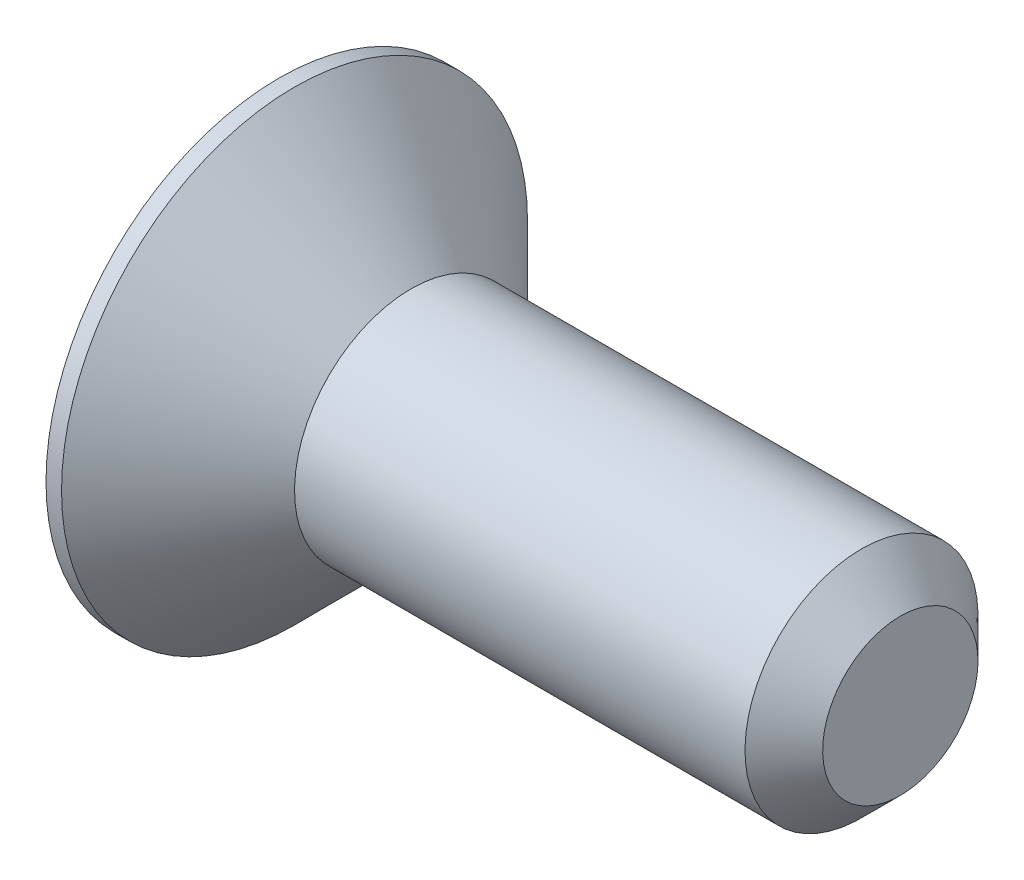
ISO-10303-21;
HEADER;
FILE_DESCRIPTION(('STEP AP214'),'2;1');
FILE_NAME('part.step','',(''),(''),'','','');
FILE_SCHEMA(('AUTOMOTIVE_DESIGN { 1 0 10303 214 1 1 1 1 }'));
ENDSEC;
DATA;
#1=APPLICATION_CONTEXT('core data for automotive mechanical design processes');
#2=APPLICATION_PROTOCOL_DEFINITION('international standard','automotive_design',2000,#1);
#3=PRODUCT_CONTEXT('',#1,'mechanical');
#4=PRODUCT('Part','Part','',(#3));
#5=PRODUCT_RELATED_PRODUCT_CATEGORY('part','',(#4));
#6=PRODUCT_DEFINITION_FORMATION('','',#4);
#7=PRODUCT_DEFINITION_CONTEXT('part definition',#1,'design');
#8=PRODUCT_DEFINITION('design','',#6,#7);
#9=PRODUCT_DEFINITION_SHAPE('','',#8);
#10=(LENGTH_UNIT() NAMED_UNIT(*) SI_UNIT(.MILLI.,.METRE.));
#11=(NAMED_UNIT(*) PLANE_ANGLE_UNIT() SI_UNIT($,.RADIAN.));
#12=(NAMED_UNIT(*) SI_UNIT($,.STERADIAN.) SOLID_ANGLE_UNIT());
#13=UNCERTAINTY_MEASURE_WITH_UNIT(LENGTH_MEASURE(1.E-05),#10,'distance_accuracy_value','');
#14=(GEOMETRIC_REPRESENTATION_CONTEXT(3) GLOBAL_UNCERTAINTY_ASSIGNED_CONTEXT((#13)) GLOBAL_UNIT_ASSIGNED_CONTEXT((#10,
#11,#12)) REPRESENTATION_CONTEXT('',''));
#15=CARTESIAN_POINT('',(0.,0.,0.));
#16=DIRECTION('',(0.,0.,1.));
#17=DIRECTION('',(1.,0.,0.));
#18=AXIS2_PLACEMENT_3D('',#15,#16,#17);
#19=CARTESIAN_POINT('',(0.,0.,0.));
#20=DIRECTION('',(-1.,0.,0.));
#21=DIRECTION('',(0.,-1.,0.));
#22=AXIS2_PLACEMENT_3D('',#19,#20,#21);
#23=PLANE('',#22);
#24=DIRECTION('',(0.,0.5,-0.866025403784438));
#25=VECTOR('',#24,1.);
#26=CARTESIAN_POINT('',(0.,0.577350269189626,1.));
#27=LINE('',#26,#25);
#28=CARTESIAN_POINT('',(0.,0.577350269189626,1.));
#29=VERTEX_POINT('',#28);
#30=CARTESIAN_POINT('',(0.,1.15470053837925,0.));
#31=VERTEX_POINT('',#30);
#32=EDGE_CURVE('E48',#29,#31,#27,.T.);
#33=ORIENTED_EDGE('',*,*,#32,.F.);
#34=DIRECTION('',(0.,1.,0.));
#35=VECTOR('',#34,1.);
#36=CARTESIAN_POINT('',(0.,-0.577350269189626,1.));
#37=LINE('',#36,#35);
#38=CARTESIAN_POINT('',(0.,-0.577350269189626,1.));
#39=VERTEX_POINT('',#38);
#40=EDGE_CURVE('E131',#39,#29,#37,.T.);
#41=ORIENTED_EDGE('',*,*,#40,.F.);
#42=DIRECTION('',(0.,0.5,0.866025403784439));
#43=VECTOR('',#42,1.);
#44=CARTESIAN_POINT('',(0.,-1.15470053837925,0.));
#45=LINE('',#44,#43);
#46=CARTESIAN_POINT('',(0.,-1.15470053837925,0.));
#47=VERTEX_POINT('',#46);
#48=EDGE_CURVE('E129',#47,#39,#45,.T.);
#49=ORIENTED_EDGE('',*,*,#48,.F.);
#50=DIRECTION('',(0.,-0.5,0.866025403784439));
#51=VECTOR('',#50,1.);
#52=CARTESIAN_POINT('',(0.,-0.577350269189625,-1.));
#53=LINE('',#52,#51);
#54=CARTESIAN_POINT('',(0.,-0.577350269189625,-1.));
#55=VERTEX_POINT('',#54);
#56=EDGE_CURVE('E96',#55,#47,#53,.T.);
#57=ORIENTED_EDGE('',*,*,#56,.F.);
#58=DIRECTION('',(0.,-1.,0.));
#59=VECTOR('',#58,1.);
#60=CARTESIAN_POINT('',(0.,0.577350269189626,-1.));
#61=LINE('',#60,#59);
#62=CARTESIAN_POINT('',(0.,0.577350269189626,-1.));
#63=VERTEX_POINT('',#62);
#64=EDGE_CURVE('E125',#63,#55,#61,.T.);
#65=ORIENTED_EDGE('',*,*,#64,.F.);
#66=DIRECTION('',(0.,-0.5,-0.866025403784439));
#67=VECTOR('',#66,1.);
#68=CARTESIAN_POINT('',(0.,1.15470053837925,0.));
#69=LINE('',#68,#67);
#70=EDGE_CURVE('E122',#31,#63,#69,.T.);
#71=ORIENTED_EDGE('',*,*,#70,.F.);
#72=EDGE_LOOP('',(#33,#41,#49,#57,#65,#71));
#73=FACE_BOUND('',#72,.T.);
#74=CARTESIAN_POINT('',(0.,0.,0.));
#75=DIRECTION('',(1.,0.,0.));
#76=DIRECTION('',(0.,1.,0.));
#77=AXIS2_PLACEMENT_3D('',#74,#75,#76);
#78=CIRCLE('',#77,3.);
#79=CARTESIAN_POINT('',(0.,3.,0.));
#80=VERTEX_POINT('',#79);
#81=EDGE_CURVE('E146',#80,#80,#78,.T.);
#82=ORIENTED_EDGE('',*,*,#81,.F.);
#83=EDGE_LOOP('',(#82));
#84=FACE_BOUND('',#83,.T.);
#85=ADVANCED_FACE('F33',(#73,#84),#23,.T.);
#86=CARTESIAN_POINT('',(8.,0.,0.));
#87=DIRECTION('',(1.,0.,0.));
#88=DIRECTION('',(0.,1.,0.));
#89=AXIS2_PLACEMENT_3D('',#86,#87,#88);
#90=CYLINDRICAL_SURFACE('',#89,3.);
#91=ORIENTED_EDGE('',*,*,#81,.T.);
#92=EDGE_LOOP('',(#91));
#93=FACE_BOUND('',#92,.T.);
#94=CARTESIAN_POINT('',(0.199999999999964,0.,0.));
#95=DIRECTION('',(1.,0.,0.));
#96=DIRECTION('',(0.,1.,0.));
#97=AXIS2_PLACEMENT_3D('',#94,#95,#96);
#98=CIRCLE('',#97,3.);
#99=CARTESIAN_POINT('',(0.199999999999964,3.,0.));
#100=VERTEX_POINT('',#99);
#101=EDGE_CURVE('E143',#100,#100,#98,.T.);
#102=ORIENTED_EDGE('',*,*,#101,.F.);
#103=EDGE_LOOP('',(#102));
#104=FACE_BOUND('',#103,.T.);
#105=ADVANCED_FACE('F166',(#93,#104),#90,.T.);
#106=CARTESIAN_POINT('',(1.7,0.,0.));
#107=DIRECTION('',(-1.,0.,0.));
#108=DIRECTION('',(0.,-1.,0.));
#109=AXIS2_PLACEMENT_3D('',#106,#107,#108);
#110=CONICAL_SURFACE('',#109,1.5,0.785398163397437);
#111=ORIENTED_EDGE('',*,*,#101,.T.);
#112=EDGE_LOOP('',(#111));
#113=FACE_BOUND('',#112,.T.);
#114=CARTESIAN_POINT('',(1.7,0.,0.));
#115=DIRECTION('',(1.,0.,0.));
#116=DIRECTION('',(0.,1.,0.));
#117=AXIS2_PLACEMENT_3D('',#114,#115,#116);
#118=CIRCLE('',#117,1.5);
#119=CARTESIAN_POINT('',(1.7,1.5,0.));
#120=VERTEX_POINT('',#119);
#121=EDGE_CURVE('E135',#120,#120,#118,.T.);
#122=ORIENTED_EDGE('',*,*,#121,.F.);
#123=EDGE_LOOP('',(#122));
#124=FACE_BOUND('',#123,.T.);
#125=ADVANCED_FACE('F171',(#113,#124),#110,.T.);
#126=CARTESIAN_POINT('',(8.,0.,0.));
#127=DIRECTION('',(1.,0.,0.));
#128=DIRECTION('',(0.,1.,0.));
#129=AXIS2_PLACEMENT_3D('',#126,#127,#128);
#130=CYLINDRICAL_SURFACE('',#129,1.5);
#131=CARTESIAN_POINT('',(7.5,0.,0.));
#132=DIRECTION('',(1.,0.,0.));
#133=DIRECTION('',(0.,1.,0.));
#134=AXIS2_PLACEMENT_3D('',#131,#132,#133);
#135=CIRCLE('',#134,1.5);
#136=CARTESIAN_POINT('',(7.5,1.5,0.));
#137=VERTEX_POINT('',#136);
#138=EDGE_CURVE('E11',#137,#137,#135,.F.);
#139=ORIENTED_EDGE('',*,*,#138,.T.);
#140=EDGE_LOOP('',(#139));
#141=FACE_BOUND('',#140,.T.);
#142=ORIENTED_EDGE('',*,*,#121,.T.);
#143=EDGE_LOOP('',(#142));
#144=FACE_BOUND('',#143,.T.);
#145=ADVANCED_FACE('F162',(#141,#144),#130,.T.);
#146=CARTESIAN_POINT('',(8.,1.5,0.));
#147=DIRECTION('',(1.,0.,0.));
#148=DIRECTION('',(0.,1.,0.));
#149=AXIS2_PLACEMENT_3D('',#146,#147,#148);
#150=PLANE('',#149);
#151=CARTESIAN_POINT('',(8.,0.,0.));
#152=DIRECTION('',(1.,0.,0.));
#153=DIRECTION('',(0.,1.,0.));
#154=AXIS2_PLACEMENT_3D('',#151,#152,#153);
#155=CIRCLE('',#154,0.999999999999997);
#156=CARTESIAN_POINT('',(8.,0.999999999999998,0.));
#157=VERTEX_POINT('',#156);
#158=EDGE_CURVE('E41',#157,#157,#155,.T.);
#159=ORIENTED_EDGE('',*,*,#158,.T.);
#160=EDGE_LOOP('',(#159));
#161=FACE_BOUND('',#160,.T.);
#162=ADVANCED_FACE('F151',(#161),#150,.T.);
#163=CARTESIAN_POINT('',(8.,0.,0.));
#164=DIRECTION('',(-1.,0.,0.));
#165=DIRECTION('',(0.,-1.,0.));
#166=AXIS2_PLACEMENT_3D('',#163,#164,#165);
#167=CONICAL_SURFACE('',#166,0.999999999999997,0.785398163397449);
#168=ORIENTED_EDGE('',*,*,#138,.F.);
#169=EDGE_LOOP('',(#168));
#170=FACE_BOUND('',#169,.T.);
#171=ORIENTED_EDGE('',*,*,#158,.F.);
#172=EDGE_LOOP('',(#171));
#173=FACE_BOUND('',#172,.T.);
#174=ADVANCED_FACE('F35',(#170,#173),#167,.T.);
#175=CARTESIAN_POINT('',(1.2,0.577350269189626,1.));
#176=DIRECTION('',(0.,0.866025403784439,0.5));
#177=DIRECTION('',(0.,-0.5,0.866025403784439));
#178=AXIS2_PLACEMENT_3D('',#175,#176,#177);
#179=PLANE('',#178);
#180=ORIENTED_EDGE('',*,*,#32,.T.);
#181=DIRECTION('',(-1.,0.,0.));
#182=VECTOR('',#181,1.);
#183=CARTESIAN_POINT('',(1.2,1.15470053837925,0.));
#184=LINE('',#183,#182);
#185=CARTESIAN_POINT('',(1.2,1.15470053837925,0.));
#186=VERTEX_POINT('',#185);
#187=EDGE_CURVE('E78',#186,#31,#184,.T.);
#188=ORIENTED_EDGE('',*,*,#187,.F.);
#189=DIRECTION('',(0.,0.5,-0.866025403784438));
#190=VECTOR('',#189,1.);
#191=CARTESIAN_POINT('',(1.2,0.577350269189626,1.));
#192=LINE('',#191,#190);
#193=CARTESIAN_POINT('',(1.2,0.577350269189626,1.));
#194=VERTEX_POINT('',#193);
#195=EDGE_CURVE('E133',#194,#186,#192,.T.);
#196=ORIENTED_EDGE('',*,*,#195,.F.);
#197=DIRECTION('',(-1.,0.,0.));
#198=VECTOR('',#197,1.);
#199=CARTESIAN_POINT('',(1.2,0.577350269189626,1.));
#200=LINE('',#199,#198);
#201=EDGE_CURVE('E56',#194,#29,#200,.T.);
#202=ORIENTED_EDGE('',*,*,#201,.T.);
#203=EDGE_LOOP('',(#180,#188,#196,#202));
#204=FACE_BOUND('',#203,.T.);
#205=ADVANCED_FACE('F154',(#204),#179,.F.);
#206=CARTESIAN_POINT('',(1.2,-0.577350269189627,1.));
#207=DIRECTION('',(0.,0.,1.));
#208=DIRECTION('',(0.,-1.,0.));
#209=AXIS2_PLACEMENT_3D('',#206,#207,#208);
#210=PLANE('',#209);
#211=ORIENTED_EDGE('',*,*,#40,.T.);
#212=ORIENTED_EDGE('',*,*,#201,.F.);
#213=DIRECTION('',(0.,1.,0.));
#214=VECTOR('',#213,1.);
#215=CARTESIAN_POINT('',(1.2,-0.577350269189627,1.));
#216=LINE('',#215,#214);
#217=CARTESIAN_POINT('',(1.2,-0.577350269189627,1.));
#218=VERTEX_POINT('',#217);
#219=EDGE_CURVE('E108',#218,#194,#216,.T.);
#220=ORIENTED_EDGE('',*,*,#219,.F.);
#221=DIRECTION('',(-1.,0.,0.));
#222=VECTOR('',#221,1.);
#223=CARTESIAN_POINT('',(1.2,-0.577350269189627,1.));
#224=LINE('',#223,#222);
#225=EDGE_CURVE('E100',#218,#39,#224,.T.);
#226=ORIENTED_EDGE('',*,*,#225,.T.);
#227=EDGE_LOOP('',(#211,#212,#220,#226));
#228=FACE_BOUND('',#227,.T.);
#229=ADVANCED_FACE('F160',(#228),#210,.F.);
#230=CARTESIAN_POINT('',(1.2,-1.15470053837925,0.));
#231=DIRECTION('',(0.,-0.866025403784439,0.5));
#232=DIRECTION('',(0.,-0.5,-0.866025403784439));
#233=AXIS2_PLACEMENT_3D('',#230,#231,#232);
#234=PLANE('',#233);
#235=ORIENTED_EDGE('',*,*,#48,.T.);
#236=ORIENTED_EDGE('',*,*,#225,.F.);
#237=DIRECTION('',(0.,0.5,0.866025403784439));
#238=VECTOR('',#237,1.);
#239=CARTESIAN_POINT('',(1.2,-1.15470053837925,0.));
#240=LINE('',#239,#238);
#241=CARTESIAN_POINT('',(1.2,-1.15470053837925,0.));
#242=VERTEX_POINT('',#241);
#243=EDGE_CURVE('E104',#242,#218,#240,.T.);
#244=ORIENTED_EDGE('',*,*,#243,.F.);
#245=DIRECTION('',(-1.,0.,0.));
#246=VECTOR('',#245,1.);
#247=CARTESIAN_POINT('',(1.2,-1.15470053837925,0.));
#248=LINE('',#247,#246);
#249=EDGE_CURVE('E89',#242,#47,#248,.T.);
#250=ORIENTED_EDGE('',*,*,#249,.T.);
#251=EDGE_LOOP('',(#235,#236,#244,#250));
#252=FACE_BOUND('',#251,.T.);
#253=ADVANCED_FACE('F105',(#252),#234,.F.);
#254=CARTESIAN_POINT('',(1.2,-0.577350269189626,-1.));
#255=DIRECTION('',(0.,-0.866025403784439,-0.5));
#256=DIRECTION('',(0.,0.5,-0.866025403784439));
#257=AXIS2_PLACEMENT_3D('',#254,#255,#256);
#258=PLANE('',#257);
#259=ORIENTED_EDGE('',*,*,#56,.T.);
#260=ORIENTED_EDGE('',*,*,#249,.F.);
#261=DIRECTION('',(0.,-0.5,0.866025403784439));
#262=VECTOR('',#261,1.);
#263=CARTESIAN_POINT('',(1.2,-0.577350269189626,-1.));
#264=LINE('',#263,#262);
#265=CARTESIAN_POINT('',(1.2,-0.577350269189626,-1.));
#266=VERTEX_POINT('',#265);
#267=EDGE_CURVE('E93',#266,#242,#264,.T.);
#268=ORIENTED_EDGE('',*,*,#267,.F.);
#269=DIRECTION('',(-1.,0.,0.));
#270=VECTOR('',#269,1.);
#271=CARTESIAN_POINT('',(1.2,-0.577350269189626,-1.));
#272=LINE('',#271,#270);
#273=EDGE_CURVE('E101',#266,#55,#272,.T.);
#274=ORIENTED_EDGE('',*,*,#273,.T.);
#275=EDGE_LOOP('',(#259,#260,#268,#274));
#276=FACE_BOUND('',#275,.T.);
#277=ADVANCED_FACE('F91',(#276),#258,.F.);
#278=CARTESIAN_POINT('',(1.2,0.577350269189626,-1.));
#279=DIRECTION('',(0.,0.,-1.));
#280=DIRECTION('',(-1.,0.,0.));
#281=AXIS2_PLACEMENT_3D('',#278,#279,#280);
#282=PLANE('',#281);
#283=ORIENTED_EDGE('',*,*,#64,.T.);
#284=ORIENTED_EDGE('',*,*,#273,.F.);
#285=DIRECTION('',(0.,-1.,0.));
#286=VECTOR('',#285,1.);
#287=CARTESIAN_POINT('',(1.2,0.577350269189626,-1.));
#288=LINE('',#287,#286);
#289=CARTESIAN_POINT('',(1.2,0.577350269189626,-1.));
#290=VERTEX_POINT('',#289);
#291=EDGE_CURVE('E114',#290,#266,#288,.T.);
#292=ORIENTED_EDGE('',*,*,#291,.F.);
#293=DIRECTION('',(-1.,0.,0.));
#294=VECTOR('',#293,1.);
#295=CARTESIAN_POINT('',(1.2,0.577350269189626,-1.));
#296=LINE('',#295,#294);
#297=EDGE_CURVE('E138',#290,#63,#296,.T.);
#298=ORIENTED_EDGE('',*,*,#297,.T.);
#299=EDGE_LOOP('',(#283,#284,#292,#298));
#300=FACE_BOUND('',#299,.T.);
#301=ADVANCED_FACE('F185',(#300),#282,.F.);
#302=CARTESIAN_POINT('',(1.2,1.15470053837925,0.));
#303=DIRECTION('',(0.,0.866025403784439,-0.5));
#304=DIRECTION('',(0.,0.5,0.866025403784439));
#305=AXIS2_PLACEMENT_3D('',#302,#303,#304);
#306=PLANE('',#305);
#307=ORIENTED_EDGE('',*,*,#70,.T.);
#308=ORIENTED_EDGE('',*,*,#297,.F.);
#309=DIRECTION('',(0.,-0.5,-0.866025403784439));
#310=VECTOR('',#309,1.);
#311=CARTESIAN_POINT('',(1.2,1.15470053837925,0.));
#312=LINE('',#311,#310);
#313=EDGE_CURVE('E116',#186,#290,#312,.T.);
#314=ORIENTED_EDGE('',*,*,#313,.F.);
#315=ORIENTED_EDGE('',*,*,#187,.T.);
#316=EDGE_LOOP('',(#307,#308,#314,#315));
#317=FACE_BOUND('',#316,.T.);
#318=ADVANCED_FACE('F182',(#317),#306,.F.);
#319=CARTESIAN_POINT('',(1.2,0.,0.));
#320=DIRECTION('',(-1.,0.,0.));
#321=DIRECTION('',(0.,-1.,0.));
#322=AXIS2_PLACEMENT_3D('',#319,#320,#321);
#323=PLANE('',#322);
#324=ORIENTED_EDGE('',*,*,#195,.T.);
#325=ORIENTED_EDGE('',*,*,#313,.T.);
#326=ORIENTED_EDGE('',*,*,#291,.T.);
#327=ORIENTED_EDGE('',*,*,#267,.T.);
#328=ORIENTED_EDGE('',*,*,#243,.T.);
#329=ORIENTED_EDGE('',*,*,#219,.T.);
#330=EDGE_LOOP('',(#324,#325,#326,#327,#328,#329));
#331=FACE_BOUND('',#330,.T.);
#332=ADVANCED_FACE('F111',(#331),#323,.T.);
#333=CLOSED_SHELL('',(#85,#105,#125,#145,#162,#174,#205,#229,#253,#277,#301,#318,#332));
#334=MANIFOLD_SOLID_BREP('B2',#333);
#335=ADVANCED_BREP_SHAPE_REPRESENTATION('',(#18,#334),#14);
#336=SHAPE_DEFINITION_REPRESENTATION(#9,#335);
ENDSEC;
END-ISO-10303-21;
